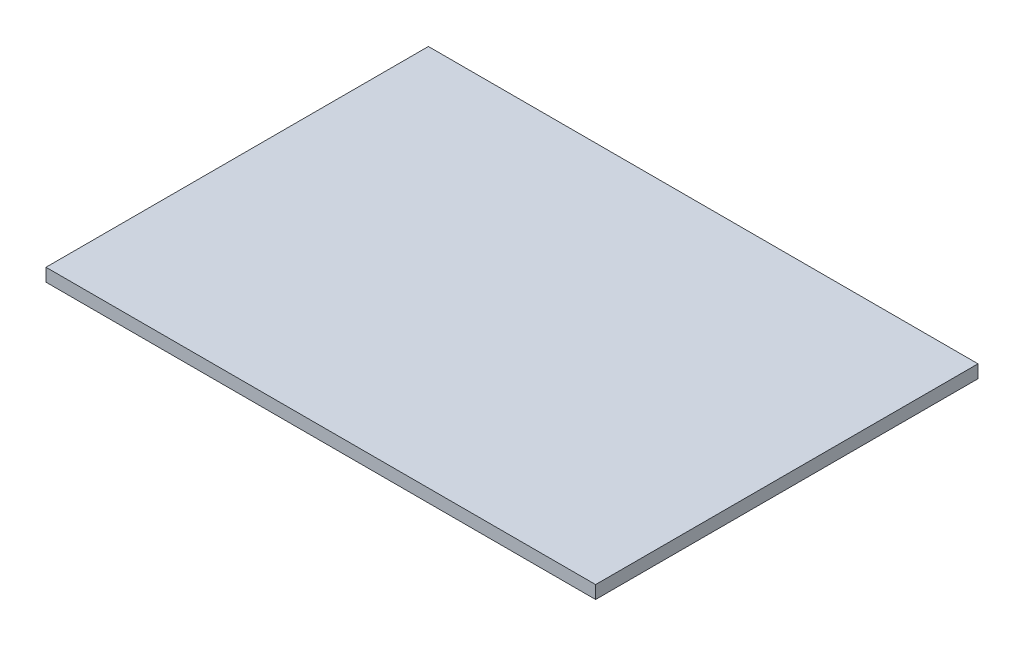
ISO-10303-21;
HEADER;
FILE_DESCRIPTION(('STEP AP214'),'2;1');
FILE_NAME('part.step','',(''),(''),'','','');
FILE_SCHEMA(('AUTOMOTIVE_DESIGN { 1 0 10303 214 1 1 1 1 }'));
ENDSEC;
DATA;
#1=APPLICATION_CONTEXT('core data for automotive mechanical design processes');
#2=APPLICATION_PROTOCOL_DEFINITION('international standard','automotive_design',2000,#1);
#3=PRODUCT_CONTEXT('',#1,'mechanical');
#4=PRODUCT('Part','Part','',(#3));
#5=PRODUCT_RELATED_PRODUCT_CATEGORY('part','',(#4));
#6=PRODUCT_DEFINITION_FORMATION('','',#4);
#7=PRODUCT_DEFINITION_CONTEXT('part definition',#1,'design');
#8=PRODUCT_DEFINITION('design','',#6,#7);
#9=PRODUCT_DEFINITION_SHAPE('','',#8);
#10=(LENGTH_UNIT() NAMED_UNIT(*) SI_UNIT(.MILLI.,.METRE.));
#11=(NAMED_UNIT(*) PLANE_ANGLE_UNIT() SI_UNIT($,.RADIAN.));
#12=(NAMED_UNIT(*) SI_UNIT($,.STERADIAN.) SOLID_ANGLE_UNIT());
#13=UNCERTAINTY_MEASURE_WITH_UNIT(LENGTH_MEASURE(1.E-05),#10,'distance_accuracy_value','');
#14=(GEOMETRIC_REPRESENTATION_CONTEXT(3) GLOBAL_UNCERTAINTY_ASSIGNED_CONTEXT((#13)) GLOBAL_UNIT_ASSIGNED_CONTEXT((#10,
#11,#12)) REPRESENTATION_CONTEXT('',''));
#15=CARTESIAN_POINT('',(0.,0.,0.));
#16=DIRECTION('',(0.,0.,1.));
#17=DIRECTION('',(1.,0.,0.));
#18=AXIS2_PLACEMENT_3D('',#15,#16,#17);
#19=CARTESIAN_POINT('',(212.,-10.,-147.5));
#20=DIRECTION('',(1.,0.,0.));
#21=DIRECTION('',(0.,0.,-1.));
#22=AXIS2_PLACEMENT_3D('',#19,#20,#21);
#23=PLANE('',#22);
#24=DIRECTION('',(0.,0.,-1.));
#25=VECTOR('',#24,1.);
#26=CARTESIAN_POINT('',(212.,0.,-147.5));
#27=LINE('',#26,#25);
#28=CARTESIAN_POINT('',(212.,0.,147.5));
#29=VERTEX_POINT('',#28);
#30=CARTESIAN_POINT('',(212.,0.,-147.5));
#31=VERTEX_POINT('',#30);
#32=EDGE_CURVE('E97',#29,#31,#27,.T.);
#33=ORIENTED_EDGE('',*,*,#32,.F.);
#34=DIRECTION('',(0.,1.,0.));
#35=VECTOR('',#34,1.);
#36=CARTESIAN_POINT('',(212.,-10.,147.5));
#37=LINE('',#36,#35);
#38=CARTESIAN_POINT('',(212.,-10.,147.5));
#39=VERTEX_POINT('',#38);
#40=EDGE_CURVE('E11',#39,#29,#37,.T.);
#41=ORIENTED_EDGE('',*,*,#40,.F.);
#42=DIRECTION('',(0.,0.,-1.));
#43=VECTOR('',#42,1.);
#44=CARTESIAN_POINT('',(212.,-10.,-147.5));
#45=LINE('',#44,#43);
#46=CARTESIAN_POINT('',(212.,-10.,-147.5));
#47=VERTEX_POINT('',#46);
#48=EDGE_CURVE('E91',#39,#47,#45,.T.);
#49=ORIENTED_EDGE('',*,*,#48,.T.);
#50=DIRECTION('',(0.,1.,0.));
#51=VECTOR('',#50,1.);
#52=CARTESIAN_POINT('',(212.,-10.,-147.5));
#53=LINE('',#52,#51);
#54=EDGE_CURVE('E36',#47,#31,#53,.T.);
#55=ORIENTED_EDGE('',*,*,#54,.T.);
#56=EDGE_LOOP('',(#33,#41,#49,#55));
#57=FACE_BOUND('',#56,.T.);
#58=ADVANCED_FACE('F33',(#57),#23,.T.);
#59=CARTESIAN_POINT('',(-212.,-10.,147.5));
#60=DIRECTION('',(0.,0.,1.));
#61=DIRECTION('',(1.,0.,0.));
#62=AXIS2_PLACEMENT_3D('',#59,#60,#61);
#63=PLANE('',#62);
#64=DIRECTION('',(1.,0.,0.));
#65=VECTOR('',#64,1.);
#66=CARTESIAN_POINT('',(-212.,0.,147.5));
#67=LINE('',#66,#65);
#68=CARTESIAN_POINT('',(-212.,0.,147.5));
#69=VERTEX_POINT('',#68);
#70=EDGE_CURVE('E93',#69,#29,#67,.T.);
#71=ORIENTED_EDGE('',*,*,#70,.F.);
#72=DIRECTION('',(0.,1.,0.));
#73=VECTOR('',#72,1.);
#74=CARTESIAN_POINT('',(-212.,-10.,147.5));
#75=LINE('',#74,#73);
#76=CARTESIAN_POINT('',(-212.,-10.,147.5));
#77=VERTEX_POINT('',#76);
#78=EDGE_CURVE('E42',#77,#69,#75,.T.);
#79=ORIENTED_EDGE('',*,*,#78,.F.);
#80=DIRECTION('',(1.,0.,0.));
#81=VECTOR('',#80,1.);
#82=CARTESIAN_POINT('',(-212.,-10.,147.5));
#83=LINE('',#82,#81);
#84=EDGE_CURVE('E88',#77,#39,#83,.T.);
#85=ORIENTED_EDGE('',*,*,#84,.T.);
#86=ORIENTED_EDGE('',*,*,#40,.T.);
#87=EDGE_LOOP('',(#71,#79,#85,#86));
#88=FACE_BOUND('',#87,.T.);
#89=ADVANCED_FACE('F107',(#88),#63,.T.);
#90=CARTESIAN_POINT('',(-212.,-10.,-147.5));
#91=DIRECTION('',(-1.,0.,0.));
#92=DIRECTION('',(0.,0.,1.));
#93=AXIS2_PLACEMENT_3D('',#90,#91,#92);
#94=PLANE('',#93);
#95=DIRECTION('',(0.,0.,1.));
#96=VECTOR('',#95,1.);
#97=CARTESIAN_POINT('',(-212.,0.,-147.5));
#98=LINE('',#97,#96);
#99=CARTESIAN_POINT('',(-212.,0.,-147.5));
#100=VERTEX_POINT('',#99);
#101=EDGE_CURVE('E83',#100,#69,#98,.T.);
#102=ORIENTED_EDGE('',*,*,#101,.F.);
#103=DIRECTION('',(0.,1.,0.));
#104=VECTOR('',#103,1.);
#105=CARTESIAN_POINT('',(-212.,-10.,-147.5));
#106=LINE('',#105,#104);
#107=CARTESIAN_POINT('',(-212.,-10.,-147.5));
#108=VERTEX_POINT('',#107);
#109=EDGE_CURVE('E78',#108,#100,#106,.T.);
#110=ORIENTED_EDGE('',*,*,#109,.F.);
#111=DIRECTION('',(0.,0.,1.));
#112=VECTOR('',#111,1.);
#113=CARTESIAN_POINT('',(-212.,-10.,-147.5));
#114=LINE('',#113,#112);
#115=EDGE_CURVE('E81',#108,#77,#114,.T.);
#116=ORIENTED_EDGE('',*,*,#115,.T.);
#117=ORIENTED_EDGE('',*,*,#78,.T.);
#118=EDGE_LOOP('',(#102,#110,#116,#117));
#119=FACE_BOUND('',#118,.T.);
#120=ADVANCED_FACE('F80',(#119),#94,.T.);
#121=CARTESIAN_POINT('',(-212.,-10.,-147.5));
#122=DIRECTION('',(0.,0.,-1.));
#123=DIRECTION('',(-1.,0.,0.));
#124=AXIS2_PLACEMENT_3D('',#121,#122,#123);
#125=PLANE('',#124);
#126=DIRECTION('',(-1.,0.,0.));
#127=VECTOR('',#126,1.);
#128=CARTESIAN_POINT('',(-212.,0.,-147.5));
#129=LINE('',#128,#127);
#130=EDGE_CURVE('E100',#31,#100,#129,.T.);
#131=ORIENTED_EDGE('',*,*,#130,.F.);
#132=ORIENTED_EDGE('',*,*,#54,.F.);
#133=DIRECTION('',(-1.,0.,0.));
#134=VECTOR('',#133,1.);
#135=CARTESIAN_POINT('',(-212.,-10.,-147.5));
#136=LINE('',#135,#134);
#137=EDGE_CURVE('E87',#47,#108,#136,.T.);
#138=ORIENTED_EDGE('',*,*,#137,.T.);
#139=ORIENTED_EDGE('',*,*,#109,.T.);
#140=EDGE_LOOP('',(#131,#132,#138,#139));
#141=FACE_BOUND('',#140,.T.);
#142=ADVANCED_FACE('F90',(#141),#125,.T.);
#143=CARTESIAN_POINT('',(0.,-10.,0.));
#144=DIRECTION('',(0.,1.,0.));
#145=DIRECTION('',(0.,0.,1.));
#146=AXIS2_PLACEMENT_3D('',#143,#144,#145);
#147=PLANE('',#146);
#148=ORIENTED_EDGE('',*,*,#48,.F.);
#149=ORIENTED_EDGE('',*,*,#84,.F.);
#150=ORIENTED_EDGE('',*,*,#115,.F.);
#151=ORIENTED_EDGE('',*,*,#137,.F.);
#152=EDGE_LOOP('',(#148,#149,#150,#151));
#153=FACE_BOUND('',#152,.T.);
#154=ADVANCED_FACE('F86',(#153),#147,.F.);
#155=CARTESIAN_POINT('',(0.,0.,0.));
#156=DIRECTION('',(0.,1.,0.));
#157=DIRECTION('',(0.,0.,1.));
#158=AXIS2_PLACEMENT_3D('',#155,#156,#157);
#159=PLANE('',#158);
#160=ORIENTED_EDGE('',*,*,#32,.T.);
#161=ORIENTED_EDGE('',*,*,#130,.T.);
#162=ORIENTED_EDGE('',*,*,#101,.T.);
#163=ORIENTED_EDGE('',*,*,#70,.T.);
#164=EDGE_LOOP('',(#160,#161,#162,#163));
#165=FACE_BOUND('',#164,.T.);
#166=ADVANCED_FACE('F106',(#165),#159,.T.);
#167=CLOSED_SHELL('',(#58,#89,#120,#142,#154,#166));
#168=MANIFOLD_SOLID_BREP('B2',#167);
#169=ADVANCED_BREP_SHAPE_REPRESENTATION('',(#18,#168),#14);
#170=SHAPE_DEFINITION_REPRESENTATION(#9,#169);
ENDSEC;
END-ISO-10303-21;
